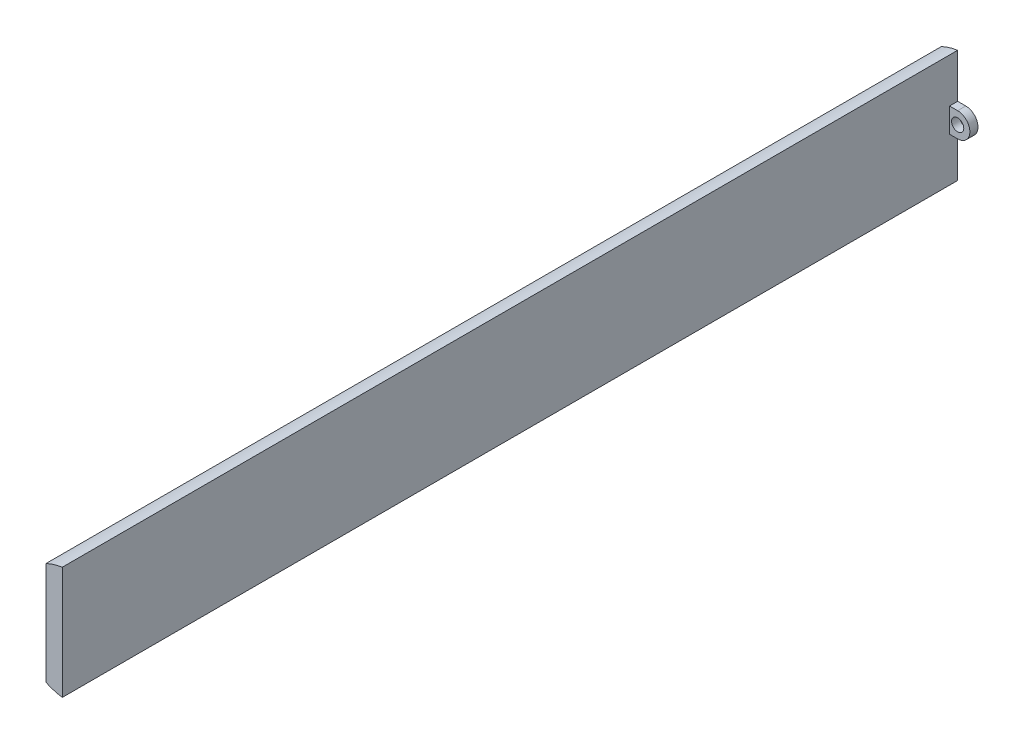
ISO-10303-21;
HEADER;
FILE_DESCRIPTION(('STEP AP214'),'2;1');
FILE_NAME('part.step','',(''),(''),'','','');
FILE_SCHEMA(('AUTOMOTIVE_DESIGN { 1 0 10303 214 1 1 1 1 }'));
ENDSEC;
DATA;
#1=APPLICATION_CONTEXT('core data for automotive mechanical design processes');
#2=APPLICATION_PROTOCOL_DEFINITION('international standard','automotive_design',2000,#1);
#3=PRODUCT_CONTEXT('',#1,'mechanical');
#4=PRODUCT('Part','Part','',(#3));
#5=PRODUCT_RELATED_PRODUCT_CATEGORY('part','',(#4));
#6=PRODUCT_DEFINITION_FORMATION('','',#4);
#7=PRODUCT_DEFINITION_CONTEXT('part definition',#1,'design');
#8=PRODUCT_DEFINITION('design','',#6,#7);
#9=PRODUCT_DEFINITION_SHAPE('','',#8);
#10=(LENGTH_UNIT() NAMED_UNIT(*) SI_UNIT(.MILLI.,.METRE.));
#11=(NAMED_UNIT(*) PLANE_ANGLE_UNIT() SI_UNIT($,.RADIAN.));
#12=(NAMED_UNIT(*) SI_UNIT($,.STERADIAN.) SOLID_ANGLE_UNIT());
#13=UNCERTAINTY_MEASURE_WITH_UNIT(LENGTH_MEASURE(1.E-05),#10,'distance_accuracy_value','');
#14=(GEOMETRIC_REPRESENTATION_CONTEXT(3) GLOBAL_UNCERTAINTY_ASSIGNED_CONTEXT((#13)) GLOBAL_UNIT_ASSIGNED_CONTEXT((#10,
#11,#12)) REPRESENTATION_CONTEXT('',''));
#15=CARTESIAN_POINT('',(0.,0.,0.));
#16=DIRECTION('',(0.,0.,1.));
#17=DIRECTION('',(1.,0.,0.));
#18=AXIS2_PLACEMENT_3D('',#15,#16,#17);
#19=CARTESIAN_POINT('',(-0.999999999999999,0.,110.));
#20=DIRECTION('',(1.,0.,0.));
#21=DIRECTION('',(0.,1.,0.));
#22=AXIS2_PLACEMENT_3D('',#19,#20,#21);
#23=PLANE('',#22);
#24=DIRECTION('',(0.,0.,-1.));
#25=VECTOR('',#24,1.);
#26=CARTESIAN_POINT('',(-0.999999999999999,-1.5,1.));
#27=LINE('',#26,#25);
#28=CARTESIAN_POINT('',(-0.999999999999999,-1.5,1.));
#29=VERTEX_POINT('',#28);
#30=CARTESIAN_POINT('',(-0.999999999999999,-1.5,0.));
#31=VERTEX_POINT('',#30);
#32=EDGE_CURVE('E139',#29,#31,#27,.T.);
#33=ORIENTED_EDGE('',*,*,#32,.F.);
#34=DIRECTION('',(0.,-1.,0.));
#35=VECTOR('',#34,1.);
#36=CARTESIAN_POINT('',(-0.999999999999999,0.,1.));
#37=LINE('',#36,#35);
#38=CARTESIAN_POINT('',(-0.999999999999999,1.5,1.));
#39=VERTEX_POINT('',#38);
#40=EDGE_CURVE('E131',#39,#29,#37,.T.);
#41=ORIENTED_EDGE('',*,*,#40,.F.);
#42=DIRECTION('',(0.,0.,-1.));
#43=VECTOR('',#42,1.);
#44=CARTESIAN_POINT('',(-0.999999999999999,1.5,1.));
#45=LINE('',#44,#43);
#46=CARTESIAN_POINT('',(-0.999999999999999,1.5,0.));
#47=VERTEX_POINT('',#46);
#48=EDGE_CURVE('E148',#39,#47,#45,.T.);
#49=ORIENTED_EDGE('',*,*,#48,.T.);
#50=DIRECTION('',(0.,-1.,0.));
#51=VECTOR('',#50,1.);
#52=CARTESIAN_POINT('',(-0.999999999999999,0.,0.));
#53=LINE('',#52,#51);
#54=CARTESIAN_POINT('',(-1.,6.92820323027551,0.));
#55=VERTEX_POINT('',#54);
#56=EDGE_CURVE('E160',#55,#47,#53,.T.);
#57=ORIENTED_EDGE('',*,*,#56,.F.);
#58=DIRECTION('',(0.,0.,-1.));
#59=VECTOR('',#58,1.);
#60=CARTESIAN_POINT('',(-1.,6.92820323027551,110.));
#61=LINE('',#60,#59);
#62=CARTESIAN_POINT('',(-1.,6.92820323027551,110.));
#63=VERTEX_POINT('',#62);
#64=EDGE_CURVE('E11',#63,#55,#61,.T.);
#65=ORIENTED_EDGE('',*,*,#64,.F.);
#66=DIRECTION('',(0.,-1.,0.));
#67=VECTOR('',#66,1.);
#68=CARTESIAN_POINT('',(-0.999999999999999,0.,110.));
#69=LINE('',#68,#67);
#70=CARTESIAN_POINT('',(-0.999999999999998,-6.92820323027551,110.));
#71=VERTEX_POINT('',#70);
#72=EDGE_CURVE('E151',#63,#71,#69,.T.);
#73=ORIENTED_EDGE('',*,*,#72,.T.);
#74=DIRECTION('',(0.,0.,-1.));
#75=VECTOR('',#74,1.);
#76=CARTESIAN_POINT('',(-0.999999999999998,-6.92820323027551,110.));
#77=LINE('',#76,#75);
#78=CARTESIAN_POINT('',(-0.999999999999998,-6.92820323027551,0.));
#79=VERTEX_POINT('',#78);
#80=EDGE_CURVE('E159',#71,#79,#77,.T.);
#81=ORIENTED_EDGE('',*,*,#80,.T.);
#82=EDGE_CURVE('E79',#31,#79,#53,.T.);
#83=ORIENTED_EDGE('',*,*,#82,.F.);
#84=EDGE_LOOP('',(#33,#41,#49,#57,#65,#73,#81,#83));
#85=FACE_BOUND('',#84,.T.);
#86=ADVANCED_FACE('F35',(#85),#23,.T.);
#87=CARTESIAN_POINT('',(0.,0.,110.));
#88=DIRECTION('',(0.,0.,-1.));
#89=DIRECTION('',(-1.,0.,0.));
#90=AXIS2_PLACEMENT_3D('',#87,#88,#89);
#91=CYLINDRICAL_SURFACE('',#90,7.);
#92=CARTESIAN_POINT('',(0.,0.,0.));
#93=DIRECTION('',(0.,0.,1.));
#94=DIRECTION('',(1.,0.,0.));
#95=AXIS2_PLACEMENT_3D('',#92,#93,#94);
#96=CIRCLE('',#95,7.);
#97=CARTESIAN_POINT('',(-3.,6.32455532033676,0.));
#98=VERTEX_POINT('',#97);
#99=EDGE_CURVE('E163',#55,#98,#96,.T.);
#100=ORIENTED_EDGE('',*,*,#99,.T.);
#101=DIRECTION('',(0.,0.,-1.));
#102=VECTOR('',#101,1.);
#103=CARTESIAN_POINT('',(-3.,6.32455532033676,110.));
#104=LINE('',#103,#102);
#105=CARTESIAN_POINT('',(-3.,6.32455532033676,110.));
#106=VERTEX_POINT('',#105);
#107=EDGE_CURVE('E42',#106,#98,#104,.T.);
#108=ORIENTED_EDGE('',*,*,#107,.F.);
#109=CARTESIAN_POINT('',(0.,0.,110.));
#110=DIRECTION('',(0.,0.,1.));
#111=DIRECTION('',(1.,0.,0.));
#112=AXIS2_PLACEMENT_3D('',#109,#110,#111);
#113=CIRCLE('',#112,7.);
#114=EDGE_CURVE('E153',#63,#106,#113,.T.);
#115=ORIENTED_EDGE('',*,*,#114,.F.);
#116=ORIENTED_EDGE('',*,*,#64,.T.);
#117=EDGE_LOOP('',(#100,#108,#115,#116));
#118=FACE_BOUND('',#117,.T.);
#119=ADVANCED_FACE('F186',(#118),#91,.T.);
#120=CARTESIAN_POINT('',(-3.,0.,110.));
#121=DIRECTION('',(1.,0.,0.));
#122=DIRECTION('',(0.,1.,0.));
#123=AXIS2_PLACEMENT_3D('',#120,#121,#122);
#124=PLANE('',#123);
#125=DIRECTION('',(0.,-1.,0.));
#126=VECTOR('',#125,1.);
#127=CARTESIAN_POINT('',(-3.,0.,0.));
#128=LINE('',#127,#126);
#129=CARTESIAN_POINT('',(-3.,-6.32455532033676,0.));
#130=VERTEX_POINT('',#129);
#131=EDGE_CURVE('E165',#98,#130,#128,.T.);
#132=ORIENTED_EDGE('',*,*,#131,.T.);
#133=DIRECTION('',(0.,0.,-1.));
#134=VECTOR('',#133,1.);
#135=CARTESIAN_POINT('',(-3.,-6.32455532033676,110.));
#136=LINE('',#135,#134);
#137=CARTESIAN_POINT('',(-3.,-6.32455532033676,110.));
#138=VERTEX_POINT('',#137);
#139=EDGE_CURVE('E170',#138,#130,#136,.T.);
#140=ORIENTED_EDGE('',*,*,#139,.F.);
#141=DIRECTION('',(0.,-1.,0.));
#142=VECTOR('',#141,1.);
#143=CARTESIAN_POINT('',(-3.,0.,110.));
#144=LINE('',#143,#142);
#145=EDGE_CURVE('E156',#106,#138,#144,.T.);
#146=ORIENTED_EDGE('',*,*,#145,.F.);
#147=ORIENTED_EDGE('',*,*,#107,.T.);
#148=EDGE_LOOP('',(#132,#140,#146,#147));
#149=FACE_BOUND('',#148,.T.);
#150=ADVANCED_FACE('F177',(#149),#124,.F.);
#151=CARTESIAN_POINT('',(0.,0.,110.));
#152=DIRECTION('',(0.,0.,-1.));
#153=DIRECTION('',(-1.,0.,0.));
#154=AXIS2_PLACEMENT_3D('',#151,#152,#153);
#155=CYLINDRICAL_SURFACE('',#154,7.);
#156=CARTESIAN_POINT('',(0.,0.,0.));
#157=DIRECTION('',(0.,0.,1.));
#158=DIRECTION('',(1.,0.,0.));
#159=AXIS2_PLACEMENT_3D('',#156,#157,#158);
#160=CIRCLE('',#159,7.);
#161=EDGE_CURVE('E154',#130,#79,#160,.T.);
#162=ORIENTED_EDGE('',*,*,#161,.T.);
#163=ORIENTED_EDGE('',*,*,#80,.F.);
#164=CARTESIAN_POINT('',(0.,0.,110.));
#165=DIRECTION('',(0.,0.,1.));
#166=DIRECTION('',(1.,0.,0.));
#167=AXIS2_PLACEMENT_3D('',#164,#165,#166);
#168=CIRCLE('',#167,7.);
#169=EDGE_CURVE('E58',#138,#71,#168,.T.);
#170=ORIENTED_EDGE('',*,*,#169,.F.);
#171=ORIENTED_EDGE('',*,*,#139,.T.);
#172=EDGE_LOOP('',(#162,#163,#170,#171));
#173=FACE_BOUND('',#172,.T.);
#174=ADVANCED_FACE('F184',(#173),#155,.T.);
#175=CARTESIAN_POINT('',(0.,0.,110.));
#176=DIRECTION('',(0.,0.,1.));
#177=DIRECTION('',(1.,0.,0.));
#178=AXIS2_PLACEMENT_3D('',#175,#176,#177);
#179=PLANE('',#178);
#180=ORIENTED_EDGE('',*,*,#72,.F.);
#181=ORIENTED_EDGE('',*,*,#114,.T.);
#182=ORIENTED_EDGE('',*,*,#145,.T.);
#183=ORIENTED_EDGE('',*,*,#169,.T.);
#184=EDGE_LOOP('',(#180,#181,#182,#183));
#185=FACE_BOUND('',#184,.T.);
#186=ADVANCED_FACE('F185',(#185),#179,.T.);
#187=CARTESIAN_POINT('',(0.,0.,0.));
#188=DIRECTION('',(0.,0.,1.));
#189=DIRECTION('',(1.,0.,0.));
#190=AXIS2_PLACEMENT_3D('',#187,#188,#189);
#191=PLANE('',#190);
#192=ORIENTED_EDGE('',*,*,#56,.T.);
#193=DIRECTION('',(-1.,0.,0.));
#194=VECTOR('',#193,1.);
#195=CARTESIAN_POINT('',(0.,1.5,0.));
#196=LINE('',#195,#194);
#197=CARTESIAN_POINT('',(0.,1.5,0.));
#198=VERTEX_POINT('',#197);
#199=EDGE_CURVE('E49',#198,#47,#196,.T.);
#200=ORIENTED_EDGE('',*,*,#199,.F.);
#201=CARTESIAN_POINT('',(0.,0.,0.));
#202=DIRECTION('',(0.,0.,1.));
#203=DIRECTION('',(1.,0.,0.));
#204=AXIS2_PLACEMENT_3D('',#201,#202,#203);
#205=CIRCLE('',#204,1.5);
#206=CARTESIAN_POINT('',(0.,-1.5,0.));
#207=VERTEX_POINT('',#206);
#208=EDGE_CURVE('E144',#207,#198,#205,.T.);
#209=ORIENTED_EDGE('',*,*,#208,.F.);
#210=DIRECTION('',(-1.,0.,0.));
#211=VECTOR('',#210,1.);
#212=CARTESIAN_POINT('',(0.,-1.5,0.));
#213=LINE('',#212,#211);
#214=EDGE_CURVE('E116',#207,#31,#213,.T.);
#215=ORIENTED_EDGE('',*,*,#214,.T.);
#216=ORIENTED_EDGE('',*,*,#82,.T.);
#217=ORIENTED_EDGE('',*,*,#161,.F.);
#218=ORIENTED_EDGE('',*,*,#131,.F.);
#219=ORIENTED_EDGE('',*,*,#99,.F.);
#220=EDGE_LOOP('',(#192,#200,#209,#215,#216,#217,#218,#219));
#221=FACE_BOUND('',#220,.T.);
#222=CARTESIAN_POINT('',(0.,0.,0.));
#223=DIRECTION('',(0.,0.,1.));
#224=DIRECTION('',(1.,0.,0.));
#225=AXIS2_PLACEMENT_3D('',#222,#223,#224);
#226=CIRCLE('',#225,0.75);
#227=CARTESIAN_POINT('',(0.75,0.,0.));
#228=VERTEX_POINT('',#227);
#229=EDGE_CURVE('E140',#228,#228,#226,.T.);
#230=ORIENTED_EDGE('',*,*,#229,.T.);
#231=EDGE_LOOP('',(#230));
#232=FACE_BOUND('',#231,.T.);
#233=ADVANCED_FACE('F181',(#221,#232),#191,.F.);
#234=CARTESIAN_POINT('',(0.,-1.5,1.));
#235=DIRECTION('',(0.,-1.,0.));
#236=DIRECTION('',(0.,0.,-1.));
#237=AXIS2_PLACEMENT_3D('',#234,#235,#236);
#238=PLANE('',#237);
#239=ORIENTED_EDGE('',*,*,#214,.F.);
#240=DIRECTION('',(0.,0.,-1.));
#241=VECTOR('',#240,1.);
#242=CARTESIAN_POINT('',(0.,-1.5,1.));
#243=LINE('',#242,#241);
#244=CARTESIAN_POINT('',(0.,-1.5,1.));
#245=VERTEX_POINT('',#244);
#246=EDGE_CURVE('E110',#245,#207,#243,.T.);
#247=ORIENTED_EDGE('',*,*,#246,.F.);
#248=DIRECTION('',(-1.,0.,0.));
#249=VECTOR('',#248,1.);
#250=CARTESIAN_POINT('',(0.,-1.5,1.));
#251=LINE('',#250,#249);
#252=EDGE_CURVE('E114',#245,#29,#251,.T.);
#253=ORIENTED_EDGE('',*,*,#252,.T.);
#254=ORIENTED_EDGE('',*,*,#32,.T.);
#255=EDGE_LOOP('',(#239,#247,#253,#254));
#256=FACE_BOUND('',#255,.T.);
#257=ADVANCED_FACE('F112',(#256),#238,.T.);
#258=CARTESIAN_POINT('',(0.,0.,1.));
#259=DIRECTION('',(0.,0.,-1.));
#260=DIRECTION('',(-1.,0.,0.));
#261=AXIS2_PLACEMENT_3D('',#258,#259,#260);
#262=CYLINDRICAL_SURFACE('',#261,1.5);
#263=ORIENTED_EDGE('',*,*,#208,.T.);
#264=DIRECTION('',(0.,0.,-1.));
#265=VECTOR('',#264,1.);
#266=CARTESIAN_POINT('',(0.,1.5,1.));
#267=LINE('',#266,#265);
#268=CARTESIAN_POINT('',(0.,1.5,1.));
#269=VERTEX_POINT('',#268);
#270=EDGE_CURVE('E120',#269,#198,#267,.T.);
#271=ORIENTED_EDGE('',*,*,#270,.F.);
#272=CARTESIAN_POINT('',(0.,0.,1.));
#273=DIRECTION('',(0.,0.,1.));
#274=DIRECTION('',(1.,0.,0.));
#275=AXIS2_PLACEMENT_3D('',#272,#273,#274);
#276=CIRCLE('',#275,1.5);
#277=EDGE_CURVE('E124',#245,#269,#276,.T.);
#278=ORIENTED_EDGE('',*,*,#277,.F.);
#279=ORIENTED_EDGE('',*,*,#246,.T.);
#280=EDGE_LOOP('',(#263,#271,#278,#279));
#281=FACE_BOUND('',#280,.T.);
#282=ADVANCED_FACE('F125',(#281),#262,.T.);
#283=CARTESIAN_POINT('',(0.,1.5,1.));
#284=DIRECTION('',(0.,-1.,0.));
#285=DIRECTION('',(0.,0.,-1.));
#286=AXIS2_PLACEMENT_3D('',#283,#284,#285);
#287=PLANE('',#286);
#288=ORIENTED_EDGE('',*,*,#199,.T.);
#289=ORIENTED_EDGE('',*,*,#48,.F.);
#290=DIRECTION('',(-1.,0.,0.));
#291=VECTOR('',#290,1.);
#292=CARTESIAN_POINT('',(0.,1.5,1.));
#293=LINE('',#292,#291);
#294=EDGE_CURVE('E127',#269,#39,#293,.T.);
#295=ORIENTED_EDGE('',*,*,#294,.F.);
#296=ORIENTED_EDGE('',*,*,#270,.T.);
#297=EDGE_LOOP('',(#288,#289,#295,#296));
#298=FACE_BOUND('',#297,.T.);
#299=ADVANCED_FACE('F203',(#298),#287,.F.);
#300=CARTESIAN_POINT('',(0.,0.,1.));
#301=DIRECTION('',(0.,0.,-1.));
#302=DIRECTION('',(-1.,0.,0.));
#303=AXIS2_PLACEMENT_3D('',#300,#301,#302);
#304=CYLINDRICAL_SURFACE('',#303,0.75);
#305=CARTESIAN_POINT('',(0.,0.,1.));
#306=DIRECTION('',(0.,0.,1.));
#307=DIRECTION('',(1.,0.,0.));
#308=AXIS2_PLACEMENT_3D('',#305,#306,#307);
#309=CIRCLE('',#308,0.75);
#310=CARTESIAN_POINT('',(0.75,0.,1.));
#311=VERTEX_POINT('',#310);
#312=EDGE_CURVE('E132',#311,#311,#309,.T.);
#313=ORIENTED_EDGE('',*,*,#312,.T.);
#314=EDGE_LOOP('',(#313));
#315=FACE_BOUND('',#314,.T.);
#316=ORIENTED_EDGE('',*,*,#229,.F.);
#317=EDGE_LOOP('',(#316));
#318=FACE_BOUND('',#317,.T.);
#319=ADVANCED_FACE('F200',(#315,#318),#304,.F.);
#320=CARTESIAN_POINT('',(0.,0.,1.));
#321=DIRECTION('',(0.,0.,1.));
#322=DIRECTION('',(1.,0.,0.));
#323=AXIS2_PLACEMENT_3D('',#320,#321,#322);
#324=PLANE('',#323);
#325=ORIENTED_EDGE('',*,*,#312,.F.);
#326=EDGE_LOOP('',(#325));
#327=FACE_BOUND('',#326,.T.);
#328=ORIENTED_EDGE('',*,*,#252,.F.);
#329=ORIENTED_EDGE('',*,*,#277,.T.);
#330=ORIENTED_EDGE('',*,*,#294,.T.);
#331=ORIENTED_EDGE('',*,*,#40,.T.);
#332=EDGE_LOOP('',(#328,#329,#330,#331));
#333=FACE_BOUND('',#332,.T.);
#334=ADVANCED_FACE('F129',(#327,#333),#324,.T.);
#335=CLOSED_SHELL('',(#86,#119,#150,#174,#186,#233,#257,#282,#299,#319,#334));
#336=MANIFOLD_SOLID_BREP('B2',#335);
#337=ADVANCED_BREP_SHAPE_REPRESENTATION('',(#18,#336),#14);
#338=SHAPE_DEFINITION_REPRESENTATION(#9,#337);
ENDSEC;
END-ISO-10303-21;
